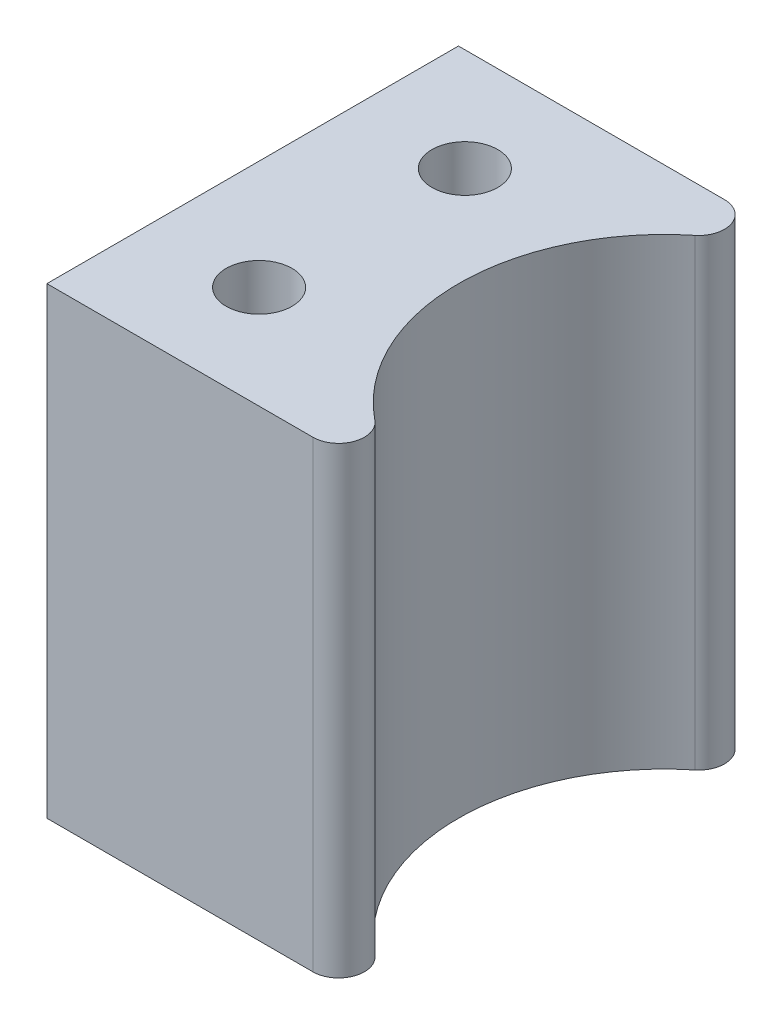
ISO-10303-21;
HEADER;
FILE_DESCRIPTION(('STEP AP214'),'2;1');
FILE_NAME('part.step','',(''),(''),'','','');
FILE_SCHEMA(('AUTOMOTIVE_DESIGN { 1 0 10303 214 1 1 1 1 }'));
ENDSEC;
DATA;
#1=APPLICATION_CONTEXT('core data for automotive mechanical design processes');
#2=APPLICATION_PROTOCOL_DEFINITION('international standard','automotive_design',2000,#1);
#3=PRODUCT_CONTEXT('',#1,'mechanical');
#4=PRODUCT('Part','Part','',(#3));
#5=PRODUCT_RELATED_PRODUCT_CATEGORY('part','',(#4));
#6=PRODUCT_DEFINITION_FORMATION('','',#4);
#7=PRODUCT_DEFINITION_CONTEXT('part definition',#1,'design');
#8=PRODUCT_DEFINITION('design','',#6,#7);
#9=PRODUCT_DEFINITION_SHAPE('','',#8);
#10=(LENGTH_UNIT() NAMED_UNIT(*) SI_UNIT(.MILLI.,.METRE.));
#11=(NAMED_UNIT(*) PLANE_ANGLE_UNIT() SI_UNIT($,.RADIAN.));
#12=(NAMED_UNIT(*) SI_UNIT($,.STERADIAN.) SOLID_ANGLE_UNIT());
#13=UNCERTAINTY_MEASURE_WITH_UNIT(LENGTH_MEASURE(1.E-05),#10,'distance_accuracy_value','');
#14=(GEOMETRIC_REPRESENTATION_CONTEXT(3) GLOBAL_UNCERTAINTY_ASSIGNED_CONTEXT((#13)) GLOBAL_UNIT_ASSIGNED_CONTEXT((#10,
#11,#12)) REPRESENTATION_CONTEXT('',''));
#15=CARTESIAN_POINT('',(0.,0.,0.));
#16=DIRECTION('',(0.,0.,1.));
#17=DIRECTION('',(1.,0.,0.));
#18=AXIS2_PLACEMENT_3D('',#15,#16,#17);
#19=CARTESIAN_POINT('',(-2.38125,28.575,-12.7));
#20=DIRECTION('',(0.,-1.,0.));
#21=DIRECTION('',(0.,0.,-1.));
#22=AXIS2_PLACEMENT_3D('',#19,#20,#21);
#23=CYLINDRICAL_SURFACE('',#22,12.7);
#24=CARTESIAN_POINT('',(-2.38125,0.,-12.7));
#25=DIRECTION('',(0.,1.,0.));
#26=DIRECTION('',(0.,0.,1.));
#27=AXIS2_PLACEMENT_3D('',#24,#25,#26);
#28=CIRCLE('',#27,12.7);
#29=CARTESIAN_POINT('',(-10.3636998853948,0.,-22.5777777777778));
#30=VERTEX_POINT('',#29);
#31=CARTESIAN_POINT('',(-10.3636998853948,0.,-2.82222222222222));
#32=VERTEX_POINT('',#31);
#33=EDGE_CURVE('E123',#30,#32,#28,.T.);
#34=ORIENTED_EDGE('',*,*,#33,.F.);
#35=DIRECTION('',(0.,-1.,0.));
#36=VECTOR('',#35,1.);
#37=CARTESIAN_POINT('',(-10.3636998853948,28.575,-22.5777777777778));
#38=LINE('',#37,#36);
#39=CARTESIAN_POINT('',(-10.3636998853948,28.575,-22.5777777777778));
#40=VERTEX_POINT('',#39);
#41=EDGE_CURVE('E11',#40,#30,#38,.T.);
#42=ORIENTED_EDGE('',*,*,#41,.F.);
#43=CARTESIAN_POINT('',(-2.38125,28.575,-12.7));
#44=DIRECTION('',(0.,1.,0.));
#45=DIRECTION('',(0.,0.,1.));
#46=AXIS2_PLACEMENT_3D('',#43,#44,#45);
#47=CIRCLE('',#46,12.7);
#48=CARTESIAN_POINT('',(-10.3636998853948,28.575,-2.82222222222222));
#49=VERTEX_POINT('',#48);
#50=EDGE_CURVE('E142',#40,#49,#47,.T.);
#51=ORIENTED_EDGE('',*,*,#50,.T.);
#52=DIRECTION('',(0.,-1.,0.));
#53=VECTOR('',#52,1.);
#54=CARTESIAN_POINT('',(-10.3636998853948,28.575,-2.82222222222222));
#55=LINE('',#54,#53);
#56=EDGE_CURVE('E78',#49,#32,#55,.T.);
#57=ORIENTED_EDGE('',*,*,#56,.T.);
#58=EDGE_LOOP('',(#34,#42,#51,#57));
#59=FACE_BOUND('',#58,.T.);
#60=ADVANCED_FACE('F34',(#59),#23,.F.);
#61=CARTESIAN_POINT('',(-11.3615061210692,28.575,-23.8125));
#62=DIRECTION('',(0.,-1.,0.));
#63=DIRECTION('',(0.,0.,-1.));
#64=AXIS2_PLACEMENT_3D('',#61,#62,#63);
#65=CYLINDRICAL_SURFACE('',#64,1.5875);
#66=CARTESIAN_POINT('',(-11.3615061210692,0.,-23.8125));
#67=DIRECTION('',(0.,1.,0.));
#68=DIRECTION('',(0.,0.,1.));
#69=AXIS2_PLACEMENT_3D('',#66,#67,#68);
#70=CIRCLE('',#69,1.5875);
#71=CARTESIAN_POINT('',(-11.3615061210692,0.,-25.4));
#72=VERTEX_POINT('',#71);
#73=EDGE_CURVE('E126',#72,#30,#70,.F.);
#74=ORIENTED_EDGE('',*,*,#73,.F.);
#75=DIRECTION('',(0.,-1.,0.));
#76=VECTOR('',#75,1.);
#77=CARTESIAN_POINT('',(-11.3615061210692,28.575,-25.4));
#78=LINE('',#77,#76);
#79=CARTESIAN_POINT('',(-11.3615061210692,28.575,-25.4));
#80=VERTEX_POINT('',#79);
#81=EDGE_CURVE('E42',#80,#72,#78,.T.);
#82=ORIENTED_EDGE('',*,*,#81,.F.);
#83=CARTESIAN_POINT('',(-11.3615061210692,28.575,-23.8125));
#84=DIRECTION('',(0.,1.,0.));
#85=DIRECTION('',(0.,0.,1.));
#86=AXIS2_PLACEMENT_3D('',#83,#84,#85);
#87=CIRCLE('',#86,1.5875);
#88=EDGE_CURVE('E112',#80,#40,#87,.F.);
#89=ORIENTED_EDGE('',*,*,#88,.T.);
#90=ORIENTED_EDGE('',*,*,#41,.T.);
#91=EDGE_LOOP('',(#74,#82,#89,#90));
#92=FACE_BOUND('',#91,.T.);
#93=ADVANCED_FACE('F151',(#92),#65,.T.);
#94=CARTESIAN_POINT('',(0.,28.575,-25.4));
#95=DIRECTION('',(0.,0.,-1.));
#96=DIRECTION('',(-1.,0.,0.));
#97=AXIS2_PLACEMENT_3D('',#94,#95,#96);
#98=PLANE('',#97);
#99=DIRECTION('',(1.,0.,0.));
#100=VECTOR('',#99,1.);
#101=CARTESIAN_POINT('',(0.,0.,-25.4));
#102=LINE('',#101,#100);
#103=CARTESIAN_POINT('',(-27.78125,0.,-25.4));
#104=VERTEX_POINT('',#103);
#105=EDGE_CURVE('E129',#104,#72,#102,.T.);
#106=ORIENTED_EDGE('',*,*,#105,.F.);
#107=DIRECTION('',(0.,-1.,0.));
#108=VECTOR('',#107,1.);
#109=CARTESIAN_POINT('',(-27.78125,28.575,-25.4));
#110=LINE('',#109,#108);
#111=CARTESIAN_POINT('',(-27.78125,28.575,-25.4));
#112=VERTEX_POINT('',#111);
#113=EDGE_CURVE('E99',#112,#104,#110,.T.);
#114=ORIENTED_EDGE('',*,*,#113,.F.);
#115=DIRECTION('',(1.,0.,0.));
#116=VECTOR('',#115,1.);
#117=CARTESIAN_POINT('',(0.,28.575,-25.4));
#118=LINE('',#117,#116);
#119=EDGE_CURVE('E110',#112,#80,#118,.T.);
#120=ORIENTED_EDGE('',*,*,#119,.T.);
#121=ORIENTED_EDGE('',*,*,#81,.T.);
#122=EDGE_LOOP('',(#106,#114,#120,#121));
#123=FACE_BOUND('',#122,.T.);
#124=ADVANCED_FACE('F148',(#123),#98,.T.);
#125=CARTESIAN_POINT('',(-27.78125,28.575,0.));
#126=DIRECTION('',(-1.,0.,0.));
#127=DIRECTION('',(0.,0.,1.));
#128=AXIS2_PLACEMENT_3D('',#125,#126,#127);
#129=PLANE('',#128);
#130=DIRECTION('',(0.,0.,-1.));
#131=VECTOR('',#130,1.);
#132=CARTESIAN_POINT('',(-27.78125,0.,0.));
#133=LINE('',#132,#131);
#134=CARTESIAN_POINT('',(-27.78125,0.,0.));
#135=VERTEX_POINT('',#134);
#136=EDGE_CURVE('E98',#135,#104,#133,.T.);
#137=ORIENTED_EDGE('',*,*,#136,.F.);
#138=DIRECTION('',(0.,-1.,0.));
#139=VECTOR('',#138,1.);
#140=CARTESIAN_POINT('',(-27.78125,28.575,0.));
#141=LINE('',#140,#139);
#142=CARTESIAN_POINT('',(-27.78125,28.575,0.));
#143=VERTEX_POINT('',#142);
#144=EDGE_CURVE('E92',#143,#135,#141,.T.);
#145=ORIENTED_EDGE('',*,*,#144,.F.);
#146=DIRECTION('',(0.,0.,-1.));
#147=VECTOR('',#146,1.);
#148=CARTESIAN_POINT('',(-27.78125,28.575,0.));
#149=LINE('',#148,#147);
#150=EDGE_CURVE('E96',#143,#112,#149,.T.);
#151=ORIENTED_EDGE('',*,*,#150,.T.);
#152=ORIENTED_EDGE('',*,*,#113,.T.);
#153=EDGE_LOOP('',(#137,#145,#151,#152));
#154=FACE_BOUND('',#153,.T.);
#155=ADVANCED_FACE('F94',(#154),#129,.T.);
#156=CARTESIAN_POINT('',(0.,28.575,0.));
#157=DIRECTION('',(0.,0.,-1.));
#158=DIRECTION('',(-1.,0.,0.));
#159=AXIS2_PLACEMENT_3D('',#156,#157,#158);
#160=PLANE('',#159);
#161=DIRECTION('',(1.,0.,0.));
#162=VECTOR('',#161,1.);
#163=CARTESIAN_POINT('',(0.,0.,0.));
#164=LINE('',#163,#162);
#165=CARTESIAN_POINT('',(-11.3615061210692,0.,0.));
#166=VERTEX_POINT('',#165);
#167=EDGE_CURVE('E71',#135,#166,#164,.T.);
#168=ORIENTED_EDGE('',*,*,#167,.T.);
#169=DIRECTION('',(0.,-1.,0.));
#170=VECTOR('',#169,1.);
#171=CARTESIAN_POINT('',(-11.3615061210692,28.575,0.));
#172=LINE('',#171,#170);
#173=CARTESIAN_POINT('',(-11.3615061210692,28.575,0.));
#174=VERTEX_POINT('',#173);
#175=EDGE_CURVE('E100',#174,#166,#172,.T.);
#176=ORIENTED_EDGE('',*,*,#175,.F.);
#177=DIRECTION('',(1.,0.,0.));
#178=VECTOR('',#177,1.);
#179=CARTESIAN_POINT('',(0.,28.575,0.));
#180=LINE('',#179,#178);
#181=EDGE_CURVE('E102',#143,#174,#180,.T.);
#182=ORIENTED_EDGE('',*,*,#181,.F.);
#183=ORIENTED_EDGE('',*,*,#144,.T.);
#184=EDGE_LOOP('',(#168,#176,#182,#183));
#185=FACE_BOUND('',#184,.T.);
#186=ADVANCED_FACE('F103',(#185),#160,.F.);
#187=CARTESIAN_POINT('',(-21.034375,28.575,-6.35));
#188=DIRECTION('',(0.,-1.,0.));
#189=DIRECTION('',(0.,0.,-1.));
#190=AXIS2_PLACEMENT_3D('',#187,#188,#189);
#191=CYLINDRICAL_SURFACE('',#190,2.032);
#192=CARTESIAN_POINT('',(-21.034375,28.575,-6.35));
#193=DIRECTION('',(0.,1.,0.));
#194=DIRECTION('',(0.,0.,1.));
#195=AXIS2_PLACEMENT_3D('',#192,#193,#194);
#196=CIRCLE('',#195,2.032);
#197=CARTESIAN_POINT('',(-21.034375,28.575,-4.318));
#198=VERTEX_POINT('',#197);
#199=EDGE_CURVE('E117',#198,#198,#196,.T.);
#200=ORIENTED_EDGE('',*,*,#199,.T.);
#201=EDGE_LOOP('',(#200));
#202=FACE_BOUND('',#201,.T.);
#203=CARTESIAN_POINT('',(-21.034375,0.,-6.35));
#204=DIRECTION('',(0.,1.,0.));
#205=DIRECTION('',(0.,0.,1.));
#206=AXIS2_PLACEMENT_3D('',#203,#204,#205);
#207=CIRCLE('',#206,2.032);
#208=CARTESIAN_POINT('',(-21.034375,0.,-4.318));
#209=VERTEX_POINT('',#208);
#210=EDGE_CURVE('E136',#209,#209,#207,.T.);
#211=ORIENTED_EDGE('',*,*,#210,.F.);
#212=EDGE_LOOP('',(#211));
#213=FACE_BOUND('',#212,.T.);
#214=ADVANCED_FACE('F172',(#202,#213),#191,.F.);
#215=CARTESIAN_POINT('',(-11.3615061210692,28.575,-1.5875));
#216=DIRECTION('',(0.,-1.,0.));
#217=DIRECTION('',(0.,0.,-1.));
#218=AXIS2_PLACEMENT_3D('',#215,#216,#217);
#219=CYLINDRICAL_SURFACE('',#218,1.5875);
#220=CARTESIAN_POINT('',(-11.3615061210692,0.,-1.5875));
#221=DIRECTION('',(0.,1.,0.));
#222=DIRECTION('',(0.,0.,1.));
#223=AXIS2_PLACEMENT_3D('',#220,#221,#222);
#224=CIRCLE('',#223,1.5875);
#225=EDGE_CURVE('E134',#166,#32,#224,.T.);
#226=ORIENTED_EDGE('',*,*,#225,.T.);
#227=ORIENTED_EDGE('',*,*,#56,.F.);
#228=CARTESIAN_POINT('',(-11.3615061210692,28.575,-1.5875));
#229=DIRECTION('',(0.,1.,0.));
#230=DIRECTION('',(0.,0.,1.));
#231=AXIS2_PLACEMENT_3D('',#228,#229,#230);
#232=CIRCLE('',#231,1.5875);
#233=EDGE_CURVE('E50',#174,#49,#232,.T.);
#234=ORIENTED_EDGE('',*,*,#233,.F.);
#235=ORIENTED_EDGE('',*,*,#175,.T.);
#236=EDGE_LOOP('',(#226,#227,#234,#235));
#237=FACE_BOUND('',#236,.T.);
#238=ADVANCED_FACE('F157',(#237),#219,.T.);
#239=CARTESIAN_POINT('',(-21.034375,28.575,-19.05));
#240=DIRECTION('',(0.,-1.,0.));
#241=DIRECTION('',(0.,0.,-1.));
#242=AXIS2_PLACEMENT_3D('',#239,#240,#241);
#243=CYLINDRICAL_SURFACE('',#242,2.032);
#244=CARTESIAN_POINT('',(-21.034375,28.575,-19.05));
#245=DIRECTION('',(0.,1.,0.));
#246=DIRECTION('',(0.,0.,1.));
#247=AXIS2_PLACEMENT_3D('',#244,#245,#246);
#248=CIRCLE('',#247,2.032);
#249=CARTESIAN_POINT('',(-21.034375,28.575,-17.018));
#250=VERTEX_POINT('',#249);
#251=EDGE_CURVE('E120',#250,#250,#248,.F.);
#252=ORIENTED_EDGE('',*,*,#251,.F.);
#253=EDGE_LOOP('',(#252));
#254=FACE_BOUND('',#253,.T.);
#255=CARTESIAN_POINT('',(-21.034375,0.,-19.05));
#256=DIRECTION('',(0.,1.,0.));
#257=DIRECTION('',(0.,0.,1.));
#258=AXIS2_PLACEMENT_3D('',#255,#256,#257);
#259=CIRCLE('',#258,2.032);
#260=CARTESIAN_POINT('',(-21.034375,0.,-17.018));
#261=VERTEX_POINT('',#260);
#262=EDGE_CURVE('E139',#261,#261,#259,.F.);
#263=ORIENTED_EDGE('',*,*,#262,.T.);
#264=EDGE_LOOP('',(#263));
#265=FACE_BOUND('',#264,.T.);
#266=ADVANCED_FACE('F175',(#254,#265),#243,.F.);
#267=CARTESIAN_POINT('',(0.,28.575,0.));
#268=DIRECTION('',(0.,1.,0.));
#269=DIRECTION('',(0.,0.,1.));
#270=AXIS2_PLACEMENT_3D('',#267,#268,#269);
#271=PLANE('',#270);
#272=ORIENTED_EDGE('',*,*,#50,.F.);
#273=ORIENTED_EDGE('',*,*,#88,.F.);
#274=ORIENTED_EDGE('',*,*,#119,.F.);
#275=ORIENTED_EDGE('',*,*,#150,.F.);
#276=ORIENTED_EDGE('',*,*,#181,.T.);
#277=ORIENTED_EDGE('',*,*,#233,.T.);
#278=EDGE_LOOP('',(#272,#273,#274,#275,#276,#277));
#279=FACE_BOUND('',#278,.T.);
#280=ORIENTED_EDGE('',*,*,#199,.F.);
#281=EDGE_LOOP('',(#280));
#282=FACE_BOUND('',#281,.T.);
#283=ORIENTED_EDGE('',*,*,#251,.T.);
#284=EDGE_LOOP('',(#283));
#285=FACE_BOUND('',#284,.T.);
#286=ADVANCED_FACE('F106',(#279,#282,#285),#271,.T.);
#287=CARTESIAN_POINT('',(0.,0.,0.));
#288=DIRECTION('',(0.,1.,0.));
#289=DIRECTION('',(0.,0.,1.));
#290=AXIS2_PLACEMENT_3D('',#287,#288,#289);
#291=PLANE('',#290);
#292=ORIENTED_EDGE('',*,*,#33,.T.);
#293=ORIENTED_EDGE('',*,*,#225,.F.);
#294=ORIENTED_EDGE('',*,*,#167,.F.);
#295=ORIENTED_EDGE('',*,*,#136,.T.);
#296=ORIENTED_EDGE('',*,*,#105,.T.);
#297=ORIENTED_EDGE('',*,*,#73,.T.);
#298=EDGE_LOOP('',(#292,#293,#294,#295,#296,#297));
#299=FACE_BOUND('',#298,.T.);
#300=ORIENTED_EDGE('',*,*,#210,.T.);
#301=EDGE_LOOP('',(#300));
#302=FACE_BOUND('',#301,.T.);
#303=ORIENTED_EDGE('',*,*,#262,.F.);
#304=EDGE_LOOP('',(#303));
#305=FACE_BOUND('',#304,.T.);
#306=ADVANCED_FACE('F153',(#299,#302,#305),#291,.F.);
#307=CLOSED_SHELL('',(#60,#93,#124,#155,#186,#214,#238,#266,#286,#306));
#308=MANIFOLD_SOLID_BREP('B2',#307);
#309=ADVANCED_BREP_SHAPE_REPRESENTATION('',(#18,#308),#14);
#310=SHAPE_DEFINITION_REPRESENTATION(#9,#309);
ENDSEC;
END-ISO-10303-21;
